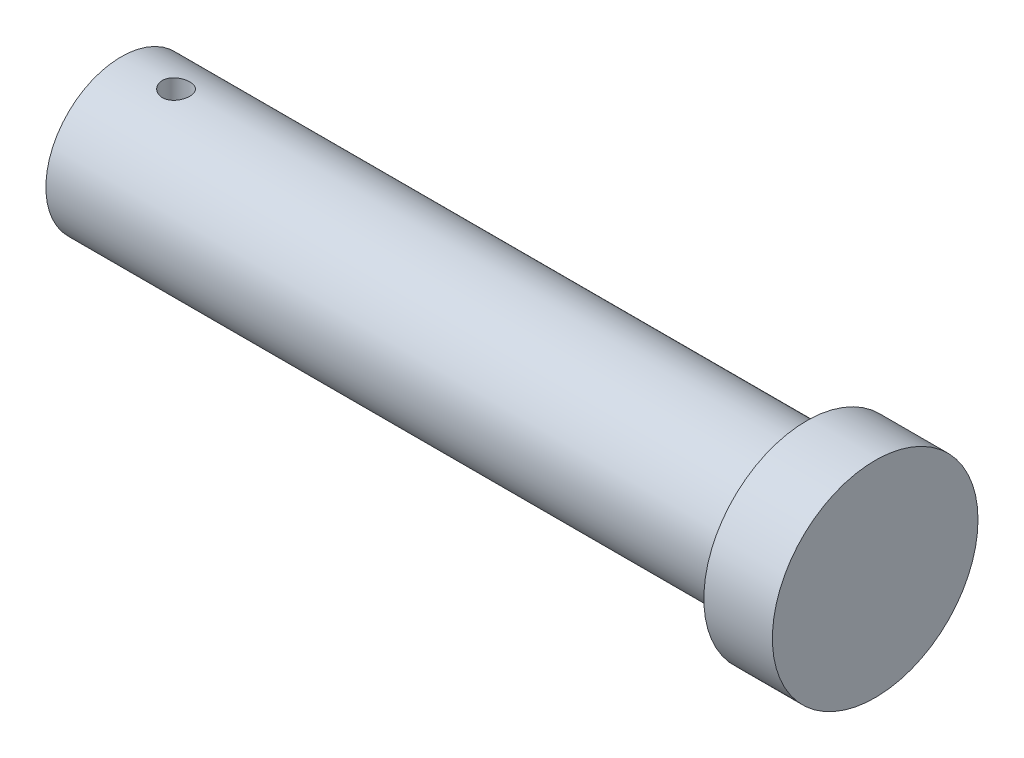
ISO-10303-21;
HEADER;
FILE_DESCRIPTION(('STEP AP214'),'2;1');
FILE_NAME('part.step','',(''),(''),'','','');
FILE_SCHEMA(('AUTOMOTIVE_DESIGN { 1 0 10303 214 1 1 1 1 }'));
ENDSEC;
DATA;
#1=APPLICATION_CONTEXT('core data for automotive mechanical design processes');
#2=APPLICATION_PROTOCOL_DEFINITION('international standard','automotive_design',2000,#1);
#3=PRODUCT_CONTEXT('',#1,'mechanical');
#4=PRODUCT('Part','Part','',(#3));
#5=PRODUCT_RELATED_PRODUCT_CATEGORY('part','',(#4));
#6=PRODUCT_DEFINITION_FORMATION('','',#4);
#7=PRODUCT_DEFINITION_CONTEXT('part definition',#1,'design');
#8=PRODUCT_DEFINITION('design','',#6,#7);
#9=PRODUCT_DEFINITION_SHAPE('','',#8);
#10=(LENGTH_UNIT() NAMED_UNIT(*) SI_UNIT(.MILLI.,.METRE.));
#11=(NAMED_UNIT(*) PLANE_ANGLE_UNIT() SI_UNIT($,.RADIAN.));
#12=(NAMED_UNIT(*) SI_UNIT($,.STERADIAN.) SOLID_ANGLE_UNIT());
#13=UNCERTAINTY_MEASURE_WITH_UNIT(LENGTH_MEASURE(1.E-05),#10,'distance_accuracy_value','');
#14=(GEOMETRIC_REPRESENTATION_CONTEXT(3) GLOBAL_UNCERTAINTY_ASSIGNED_CONTEXT((#13)) GLOBAL_UNIT_ASSIGNED_CONTEXT((#10,
#11,#12)) REPRESENTATION_CONTEXT('',''));
#15=CARTESIAN_POINT('',(0.,0.,0.));
#16=DIRECTION('',(0.,0.,1.));
#17=DIRECTION('',(1.,0.,0.));
#18=AXIS2_PLACEMENT_3D('',#15,#16,#17);
#19=CARTESIAN_POINT('',(50.,0.,0.));
#20=DIRECTION('',(-1.,0.,0.));
#21=DIRECTION('',(0.,0.,1.));
#22=AXIS2_PLACEMENT_3D('',#19,#20,#21);
#23=CYLINDRICAL_SURFACE('',#22,5.5);
#24=CARTESIAN_POINT('',(4.,-5.40832691319598,1.));
#25=CARTESIAN_POINT('',(4.05567006127892,-5.40832797364528,0.999997833744766));
#26=CARTESIAN_POINT('',(4.11136859562177,-5.40919579392021,0.995335502119674));
#27=CARTESIAN_POINT('',(4.22119730791599,-5.41256931618596,0.976820659835411));
#28=CARTESIAN_POINT('',(4.27532607983057,-5.41507644189578,0.962960160510875));
#29=CARTESIAN_POINT('',(4.38041015651648,-5.4214354513315,0.926486846446966));
#30=CARTESIAN_POINT('',(4.43136828265596,-5.42528611875607,0.903881945963433));
#31=CARTESIAN_POINT('',(4.52876494581254,-5.43389689920319,0.850582127042014));
#32=CARTESIAN_POINT('',(4.57520387900767,-5.438656932397,0.819887918635019));
#33=CARTESIAN_POINT('',(4.6627917237214,-5.4486123689521,0.750897624119711));
#34=CARTESIAN_POINT('',(4.70388003711712,-5.45381181531897,0.712525176739021));
#35=CARTESIAN_POINT('',(4.77907278141707,-5.46402446588599,0.62943269817084));
#36=CARTESIAN_POINT('',(4.81317676682265,-5.46903765818916,0.584712262381758));
#37=CARTESIAN_POINT('',(4.87366365922516,-5.47835611996116,0.489796709499925));
#38=CARTESIAN_POINT('',(4.89998963499791,-5.48265607320122,0.439564745239941));
#39=CARTESIAN_POINT('',(4.94380666651306,-5.49001838668285,0.335299887218807));
#40=CARTESIAN_POINT('',(4.96129840525468,-5.49308084259509,0.28126728766334));
#41=CARTESIAN_POINT('',(4.98676361662773,-5.49759455294158,0.171562418910428));
#42=CARTESIAN_POINT('',(4.99483915716036,-5.49906307272621,0.115914564259384));
#43=CARTESIAN_POINT('',(5.0015605837312,-5.50028290444734,0.00403573648296232));
#44=CARTESIAN_POINT('',(5.00020722678577,-5.50003435424197,-0.0521951894675192));
#45=CARTESIAN_POINT('',(4.98818792896104,-5.49786159276056,-0.16294459807037));
#46=CARTESIAN_POINT('',(4.97763187324278,-5.49595715438454,-0.217475450026675));
#47=CARTESIAN_POINT('',(4.94768040126925,-5.49070873453988,-0.323978745301683));
#48=CARTESIAN_POINT('',(4.92828467730688,-5.48736470295951,-0.375951099489802));
#49=CARTESIAN_POINT('',(4.88109847011042,-5.47957960186178,-0.476183112726924));
#50=CARTESIAN_POINT('',(4.85326367798308,-5.47513276511691,-0.524421446258733));
#51=CARTESIAN_POINT('',(4.79002205503766,-5.46563448410861,-0.615583816786463));
#52=CARTESIAN_POINT('',(4.75461449853225,-5.4605829819214,-0.65850734384911));
#53=CARTESIAN_POINT('',(4.67662577271036,-5.4503495404642,-0.738472225271972));
#54=CARTESIAN_POINT('',(4.63394849104051,-5.44516677076057,-0.775419797024746));
#55=CARTESIAN_POINT('',(4.54295296803954,-5.4353248103429,-0.84164635982083));
#56=CARTESIAN_POINT('',(4.49463465361737,-5.43066562641452,-0.870925251484836));
#57=CARTESIAN_POINT('',(4.39360874475659,-5.42239736704917,-0.921007691245463));
#58=CARTESIAN_POINT('',(4.34089458418011,-5.41878990006369,-0.941798276926112));
#59=CARTESIAN_POINT('',(4.23264127505582,-5.41305866738468,-0.97420188443499));
#60=CARTESIAN_POINT('',(4.17710242674443,-5.41093474435718,-0.985815879483377));
#61=CARTESIAN_POINT('',(4.0656200993973,-5.40844202046372,-0.999401089257729));
#62=CARTESIAN_POINT('',(4.00969353366518,-5.40804875191389,-1.00150674244582));
#63=CARTESIAN_POINT('',(3.89828772471946,-5.40899647576945,-0.996375273894247));
#64=CARTESIAN_POINT('',(3.84280846089302,-5.41033738779432,-0.989138585178942));
#65=CARTESIAN_POINT('',(3.73430982797386,-5.41457964689337,-0.965643048194485));
#66=CARTESIAN_POINT('',(3.68127480799599,-5.41746890003943,-0.94945409427688));
#67=CARTESIAN_POINT('',(3.57867014058578,-5.42447195400378,-0.908587487859388));
#68=CARTESIAN_POINT('',(3.52910073545716,-5.42858584033864,-0.88390924253054));
#69=CARTESIAN_POINT('',(3.43424040199238,-5.43763067076332,-0.826452930939968));
#70=CARTESIAN_POINT('',(3.38900194095781,-5.44257002421489,-0.793589589707832));
#71=CARTESIAN_POINT('',(3.30463315420112,-5.45268533146011,-0.720811524753681));
#72=CARTESIAN_POINT('',(3.26550334400017,-5.45786130517501,-0.680896206506622));
#73=CARTESIAN_POINT('',(3.19396357692511,-5.46794493022657,-0.594548150036306));
#74=CARTESIAN_POINT('',(3.1616438223191,-5.47284841413378,-0.548040116261882));
#75=CARTESIAN_POINT('',(3.1052768469585,-5.48176540688883,-0.450176309896763));
#76=CARTESIAN_POINT('',(3.08122932136141,-5.48577894853028,-0.398820716033923));
#77=CARTESIAN_POINT('',(3.04222598068178,-5.49244586315787,-0.292974109172671));
#78=CARTESIAN_POINT('',(3.02722504756174,-5.49510597552399,-0.238500164676974));
#79=CARTESIAN_POINT('',(3.00659632835142,-5.49879498739045,-0.12775332448174));
#80=CARTESIAN_POINT('',(3.00096761743164,-5.49982404783879,-0.0714806068396169));
#81=CARTESIAN_POINT('',(2.99927373944725,-5.50013207106945,0.0403998095144108));
#82=CARTESIAN_POINT('',(3.00307205575767,-5.49943601615581,0.0960054189627312));
#83=CARTESIAN_POINT('',(3.01982647321196,-5.49642366951049,0.205772269495427));
#84=CARTESIAN_POINT('',(3.03278249759946,-5.4941073913589,0.259933522681888));
#85=CARTESIAN_POINT('',(3.06742845174468,-5.48811453453941,0.365207716720242));
#86=CARTESIAN_POINT('',(3.08910467268796,-5.48444009174284,0.416325298323197));
#87=CARTESIAN_POINT('',(3.1405597014042,-5.47612961195727,0.514218505970988));
#88=CARTESIAN_POINT('',(3.17033900813803,-5.47149351575705,0.560993864398312));
#89=CARTESIAN_POINT('',(3.23762881928164,-5.46169295104726,0.64955729876811));
#90=CARTESIAN_POINT('',(3.27523834769477,-5.45652218977741,0.69126944929362));
#91=CARTESIAN_POINT('',(3.35691475834417,-5.44627585142043,0.767838111774054));
#92=CARTESIAN_POINT('',(3.40098315427109,-5.44120029696122,0.802693012176555));
#93=CARTESIAN_POINT('',(3.49477983780895,-5.43167141434991,0.864838359022299));
#94=CARTESIAN_POINT('',(3.54455361968942,-5.42722382409738,0.892061042527094));
#95=CARTESIAN_POINT('',(3.64803163839711,-5.41952308783751,0.937715294552637));
#96=CARTESIAN_POINT('',(3.70173204581306,-5.41626879622786,0.956155299818061));
#97=CARTESIAN_POINT('',(3.79633834221095,-5.41201405367096,0.979899481024946));
#98=CARTESIAN_POINT('',(3.83668463130228,-5.4106394360599,0.987424495948277));
#99=CARTESIAN_POINT('',(3.91801547601812,-5.40879548637076,0.997475492125671));
#100=CARTESIAN_POINT('',(3.95900001603777,-5.40832613219443,1.00000159540744));
#101=CARTESIAN_POINT('',(4.,-5.40832691319598,1.));
#102=B_SPLINE_CURVE_WITH_KNOTS('',3,(#24,#25,#26,#27,#28,#29,#30,#31,#32,#33,#34,#35,#36,#37,
#38,#39,#40,#41,#42,#43,#44,#45,#46,#47,#48,#49,#50,#51,#52,#53,#54,#55,#56,#57,#58,#59,#60,#61,
#62,#63,#64,#65,#66,#67,#68,#69,#70,#71,#72,#73,#74,#75,#76,#77,#78,#79,#80,#81,#82,#83,#84,#85,
#86,#87,#88,#89,#90,#91,#92,#93,#94,#95,#96,#97,#98,#99,#100,#101),.UNSPECIFIED.,.T.,.F.,(4,2,2,
2,2,2,2,2,2,2,2,2,2,2,2,2,2,2,2,2,2,2,2,2,2,2,2,2,2,2,2,2,2,2,2,2,2,2,4),(0.,0.166860176303694,
0.333865461691934,0.500719948670007,0.667559795037679,0.836149675555551,1.00475030631164,
1.17455606253914,1.34434868860495,1.51228319705907,1.6802042227379,1.84614722644409,
2.01209600703444,2.17893164241915,2.34578327259646,2.51504175421998,2.68430242917503,
2.85382062241291,3.02332083504319,3.19041682321415,3.35750506664222,3.52330682829013,
3.68912017065095,3.85673910114988,4.02437216970491,4.19410261282722,4.36382680048964,
4.53269736835609,4.70155127147238,4.86797423941391,5.03439581247914,5.20055677418129,
5.36672796983505,5.53514439851506,5.70360036032117,5.87350774145283,6.04325157670206,
6.16614405072609,6.28903352480283),.UNSPECIFIED.);
#103=CARTESIAN_POINT('',(4.,-5.40832691319598,1.));
#104=VERTEX_POINT('',#103);
#105=EDGE_CURVE('E35',#104,#104,#102,.T.);
#106=ORIENTED_EDGE('',*,*,#105,.T.);
#107=EDGE_LOOP('',(#106));
#108=FACE_BOUND('',#107,.T.);
#109=CARTESIAN_POINT('',(4.,5.40832691319598,1.));
#110=CARTESIAN_POINT('',(3.94432993872108,5.40832797364528,0.999997833744766));
#111=CARTESIAN_POINT('',(3.88863140437823,5.40919579392021,0.995335502119674));
#112=CARTESIAN_POINT('',(3.77880269208401,5.41256931618596,0.976820659835411));
#113=CARTESIAN_POINT('',(3.72467392016943,5.41507644189578,0.962960160510875));
#114=CARTESIAN_POINT('',(3.61958984348352,5.4214354513315,0.926486846446966));
#115=CARTESIAN_POINT('',(3.56863171734404,5.42528611875607,0.903881945963433));
#116=CARTESIAN_POINT('',(3.47123505418746,5.43389689920319,0.850582127042014));
#117=CARTESIAN_POINT('',(3.42479612099233,5.438656932397,0.819887918635019));
#118=CARTESIAN_POINT('',(3.3372082762786,5.4486123689521,0.750897624119711));
#119=CARTESIAN_POINT('',(3.29611996288288,5.45381181531897,0.71252517673902));
#120=CARTESIAN_POINT('',(3.22092721858293,5.46402446588599,0.629432698170839));
#121=CARTESIAN_POINT('',(3.18682323317735,5.46903765818916,0.584712262381757));
#122=CARTESIAN_POINT('',(3.12633634077484,5.47835611996116,0.489796709499924));
#123=CARTESIAN_POINT('',(3.10001036500209,5.48265607320122,0.439564745239941));
#124=CARTESIAN_POINT('',(3.05619333348694,5.49001838668285,0.335299887218807));
#125=CARTESIAN_POINT('',(3.03870159474532,5.49308084259509,0.28126728766334));
#126=CARTESIAN_POINT('',(3.01323638337227,5.49759455294158,0.171562418910429));
#127=CARTESIAN_POINT('',(3.00516084283964,5.49906307272621,0.115914564259384));
#128=CARTESIAN_POINT('',(2.9984394162688,5.50028290444734,0.00403573648296255));
#129=CARTESIAN_POINT('',(2.99979277321423,5.50003435424197,-0.052195189467519));
#130=CARTESIAN_POINT('',(3.01181207103896,5.49786159276056,-0.16294459807037));
#131=CARTESIAN_POINT('',(3.02236812675722,5.49595715438454,-0.217475450026675));
#132=CARTESIAN_POINT('',(3.05231959873075,5.49070873453988,-0.323978745301683));
#133=CARTESIAN_POINT('',(3.07171532269312,5.48736470295951,-0.375951099489801));
#134=CARTESIAN_POINT('',(3.11890152988958,5.47957960186178,-0.476183112726923));
#135=CARTESIAN_POINT('',(3.14673632201692,5.47513276511691,-0.524421446258733));
#136=CARTESIAN_POINT('',(3.20997794496234,5.46563448410861,-0.615583816786463));
#137=CARTESIAN_POINT('',(3.24538550146775,5.4605829819214,-0.65850734384911));
#138=CARTESIAN_POINT('',(3.32337422728964,5.4503495404642,-0.738472225271972));
#139=CARTESIAN_POINT('',(3.36605150895949,5.44516677076057,-0.775419797024746));
#140=CARTESIAN_POINT('',(3.45704703196046,5.4353248103429,-0.841646359820829));
#141=CARTESIAN_POINT('',(3.50536534638263,5.43066562641452,-0.870925251484836));
#142=CARTESIAN_POINT('',(3.60639125524341,5.42239736704917,-0.921007691245462));
#143=CARTESIAN_POINT('',(3.65910541581989,5.41878990006368,-0.941798276926111));
#144=CARTESIAN_POINT('',(3.76735872494418,5.41305866738468,-0.974201884434989));
#145=CARTESIAN_POINT('',(3.82289757325557,5.41093474435718,-0.985815879483377));
#146=CARTESIAN_POINT('',(3.93437990060271,5.40844202046372,-0.999401089257729));
#147=CARTESIAN_POINT('',(3.99030646633482,5.40804875191389,-1.00150674244582));
#148=CARTESIAN_POINT('',(4.10171227528054,5.40899647576945,-0.996375273894247));
#149=CARTESIAN_POINT('',(4.15719153910698,5.41033738779432,-0.989138585178942));
#150=CARTESIAN_POINT('',(4.26569017202614,5.41457964689337,-0.965643048194485));
#151=CARTESIAN_POINT('',(4.31872519200401,5.41746890003943,-0.949454094276879));
#152=CARTESIAN_POINT('',(4.42132985941422,5.42447195400378,-0.908587487859388));
#153=CARTESIAN_POINT('',(4.47089926454284,5.42858584033864,-0.88390924253054));
#154=CARTESIAN_POINT('',(4.56575959800762,5.43763067076332,-0.826452930939968));
#155=CARTESIAN_POINT('',(4.61099805904219,5.44257002421489,-0.793589589707833));
#156=CARTESIAN_POINT('',(4.69536684579888,5.45268533146011,-0.720811524753681));
#157=CARTESIAN_POINT('',(4.73449665599983,5.45786130517501,-0.680896206506622));
#158=CARTESIAN_POINT('',(4.80603642307489,5.46794493022657,-0.594548150036305));
#159=CARTESIAN_POINT('',(4.8383561776809,5.47284841413378,-0.548040116261882));
#160=CARTESIAN_POINT('',(4.8947231530415,5.48176540688883,-0.450176309896763));
#161=CARTESIAN_POINT('',(4.91877067863859,5.48577894853028,-0.398820716033923));
#162=CARTESIAN_POINT('',(4.95777401931822,5.49244586315787,-0.292974109172671));
#163=CARTESIAN_POINT('',(4.97277495243826,5.49510597552399,-0.238500164676974));
#164=CARTESIAN_POINT('',(4.99340367164858,5.49879498739045,-0.12775332448174));
#165=CARTESIAN_POINT('',(4.99903238256836,5.49982404783879,-0.0714806068396171));
#166=CARTESIAN_POINT('',(5.00072626055275,5.50013207106945,0.0403998095144106));
#167=CARTESIAN_POINT('',(4.99692794424233,5.49943601615581,0.0960054189627311));
#168=CARTESIAN_POINT('',(4.98017352678804,5.49642366951049,0.205772269495427));
#169=CARTESIAN_POINT('',(4.96721750240054,5.4941073913589,0.259933522681888));
#170=CARTESIAN_POINT('',(4.93257154825532,5.48811453453941,0.365207716720242));
#171=CARTESIAN_POINT('',(4.91089532731204,5.48444009174284,0.416325298323197));
#172=CARTESIAN_POINT('',(4.8594402985958,5.47612961195727,0.514218505970988));
#173=CARTESIAN_POINT('',(4.82966099186197,5.47149351575705,0.560993864398311));
#174=CARTESIAN_POINT('',(4.76237118071836,5.46169295104726,0.64955729876811));
#175=CARTESIAN_POINT('',(4.72476165230523,5.45652218977741,0.69126944929362));
#176=CARTESIAN_POINT('',(4.64308524165583,5.44627585142043,0.767838111774055));
#177=CARTESIAN_POINT('',(4.59901684572891,5.44120029696122,0.802693012176555));
#178=CARTESIAN_POINT('',(4.50522016219105,5.43167141434991,0.864838359022299));
#179=CARTESIAN_POINT('',(4.45544638031058,5.42722382409738,0.892061042527094));
#180=CARTESIAN_POINT('',(4.35196836160289,5.41952308783751,0.937715294552637));
#181=CARTESIAN_POINT('',(4.29826795418694,5.41626879622786,0.956155299818061));
#182=CARTESIAN_POINT('',(4.20366165778905,5.41201405367096,0.979899481024945));
#183=CARTESIAN_POINT('',(4.16331536869772,5.4106394360599,0.987424495948277));
#184=CARTESIAN_POINT('',(4.08198452398188,5.40879548637076,0.997475492125671));
#185=CARTESIAN_POINT('',(4.04099998396223,5.40832613219443,1.00000159540744));
#186=CARTESIAN_POINT('',(4.,5.40832691319598,1.));
#187=B_SPLINE_CURVE_WITH_KNOTS('',3,(#109,#110,#111,#112,#113,#114,#115,#116,#117,#118,#119,
#120,#121,#122,#123,#124,#125,#126,#127,#128,#129,#130,#131,#132,#133,#134,#135,#136,#137,#138,
#139,#140,#141,#142,#143,#144,#145,#146,#147,#148,#149,#150,#151,#152,#153,#154,#155,#156,#157,
#158,#159,#160,#161,#162,#163,#164,#165,#166,#167,#168,#169,#170,#171,#172,#173,#174,#175,#176,
#177,#178,#179,#180,#181,#182,#183,#184,#185,#186),.UNSPECIFIED.,.T.,.F.,(4,2,2,2,2,2,2,2,2,2,2,
2,2,2,2,2,2,2,2,2,2,2,2,2,2,2,2,2,2,2,2,2,2,2,2,2,2,2,4),(0.,0.166860176303694,
0.333865461691933,0.500719948670007,0.66755979503768,0.836149675555552,1.00475030631164,
1.17455606253914,1.34434868860495,1.51228319705907,1.6802042227379,1.84614722644409,
2.01209600703444,2.17893164241915,2.34578327259646,2.51504175421998,2.68430242917503,
2.85382062241291,3.02332083504319,3.19041682321415,3.35750506664222,3.52330682829013,
3.68912017065095,3.85673910114988,4.02437216970491,4.19410261282722,4.36382680048964,
4.53269736835609,4.70155127147238,4.86797423941391,5.03439581247915,5.20055677418129,
5.36672796983505,5.53514439851506,5.70360036032117,5.87350774145283,6.04325157670206,
6.16614405072609,6.28903352480283),.UNSPECIFIED.);
#188=CARTESIAN_POINT('',(4.,5.40832691319598,1.));
#189=VERTEX_POINT('',#188);
#190=EDGE_CURVE('E53',#189,#189,#187,.T.);
#191=ORIENTED_EDGE('',*,*,#190,.T.);
#192=EDGE_LOOP('',(#191));
#193=FACE_BOUND('',#192,.T.);
#194=CARTESIAN_POINT('',(50.,0.,0.));
#195=DIRECTION('',(1.,0.,0.));
#196=DIRECTION('',(0.,0.,-1.));
#197=AXIS2_PLACEMENT_3D('',#194,#195,#196);
#198=CIRCLE('',#197,5.5);
#199=CARTESIAN_POINT('',(50.,0.,-5.5));
#200=VERTEX_POINT('',#199);
#201=EDGE_CURVE('E10',#200,#200,#198,.T.);
#202=ORIENTED_EDGE('',*,*,#201,.F.);
#203=EDGE_LOOP('',(#202));
#204=FACE_BOUND('',#203,.T.);
#205=CARTESIAN_POINT('',(0.,0.,0.));
#206=DIRECTION('',(1.,0.,0.));
#207=DIRECTION('',(0.,0.,-1.));
#208=AXIS2_PLACEMENT_3D('',#205,#206,#207);
#209=CIRCLE('',#208,5.5);
#210=CARTESIAN_POINT('',(0.,0.,-5.5));
#211=VERTEX_POINT('',#210);
#212=EDGE_CURVE('E43',#211,#211,#209,.T.);
#213=ORIENTED_EDGE('',*,*,#212,.T.);
#214=EDGE_LOOP('',(#213));
#215=FACE_BOUND('',#214,.T.);
#216=ADVANCED_FACE('F31',(#108,#193,#204,#215),#23,.T.);
#217=CARTESIAN_POINT('',(0.,0.,0.));
#218=DIRECTION('',(1.,0.,0.));
#219=DIRECTION('',(0.,0.,-1.));
#220=AXIS2_PLACEMENT_3D('',#217,#218,#219);
#221=PLANE('',#220);
#222=ORIENTED_EDGE('',*,*,#212,.F.);
#223=EDGE_LOOP('',(#222));
#224=FACE_BOUND('',#223,.T.);
#225=ADVANCED_FACE('F73',(#224),#221,.F.);
#226=CARTESIAN_POINT('',(55.,0.,0.));
#227=DIRECTION('',(-1.,0.,0.));
#228=DIRECTION('',(0.,0.,1.));
#229=AXIS2_PLACEMENT_3D('',#226,#227,#228);
#230=CYLINDRICAL_SURFACE('',#229,7.5);
#231=CARTESIAN_POINT('',(55.,0.,0.));
#232=DIRECTION('',(1.,0.,0.));
#233=DIRECTION('',(0.,0.,-1.));
#234=AXIS2_PLACEMENT_3D('',#231,#232,#233);
#235=CIRCLE('',#234,7.5);
#236=CARTESIAN_POINT('',(55.,0.,-7.5));
#237=VERTEX_POINT('',#236);
#238=EDGE_CURVE('E48',#237,#237,#235,.T.);
#239=ORIENTED_EDGE('',*,*,#238,.F.);
#240=EDGE_LOOP('',(#239));
#241=FACE_BOUND('',#240,.T.);
#242=CARTESIAN_POINT('',(50.,0.,0.));
#243=DIRECTION('',(1.,0.,0.));
#244=DIRECTION('',(0.,0.,-1.));
#245=AXIS2_PLACEMENT_3D('',#242,#243,#244);
#246=CIRCLE('',#245,7.5);
#247=CARTESIAN_POINT('',(50.,0.,-7.5));
#248=VERTEX_POINT('',#247);
#249=EDGE_CURVE('E51',#248,#248,#246,.T.);
#250=ORIENTED_EDGE('',*,*,#249,.T.);
#251=EDGE_LOOP('',(#250));
#252=FACE_BOUND('',#251,.T.);
#253=ADVANCED_FACE('F68',(#241,#252),#230,.T.);
#254=CARTESIAN_POINT('',(55.,0.,0.));
#255=DIRECTION('',(1.,0.,0.));
#256=DIRECTION('',(0.,0.,-1.));
#257=AXIS2_PLACEMENT_3D('',#254,#255,#256);
#258=PLANE('',#257);
#259=ORIENTED_EDGE('',*,*,#238,.T.);
#260=EDGE_LOOP('',(#259));
#261=FACE_BOUND('',#260,.T.);
#262=ADVANCED_FACE('F64',(#261),#258,.T.);
#263=CARTESIAN_POINT('',(50.,0.,0.));
#264=DIRECTION('',(1.,0.,0.));
#265=DIRECTION('',(0.,0.,-1.));
#266=AXIS2_PLACEMENT_3D('',#263,#264,#265);
#267=PLANE('',#266);
#268=ORIENTED_EDGE('',*,*,#201,.T.);
#269=EDGE_LOOP('',(#268));
#270=FACE_BOUND('',#269,.T.);
#271=ORIENTED_EDGE('',*,*,#249,.F.);
#272=EDGE_LOOP('',(#271));
#273=FACE_BOUND('',#272,.T.);
#274=ADVANCED_FACE('F62',(#270,#273),#267,.F.);
#275=CARTESIAN_POINT('',(4.,-7.5,0.));
#276=DIRECTION('',(0.,1.,0.));
#277=DIRECTION('',(0.,0.,1.));
#278=AXIS2_PLACEMENT_3D('',#275,#276,#277);
#279=CYLINDRICAL_SURFACE('',#278,1.);
#280=ORIENTED_EDGE('',*,*,#190,.F.);
#281=EDGE_LOOP('',(#280));
#282=FACE_BOUND('',#281,.T.);
#283=ORIENTED_EDGE('',*,*,#105,.F.);
#284=EDGE_LOOP('',(#283));
#285=FACE_BOUND('',#284,.T.);
#286=ADVANCED_FACE('F58',(#282,#285),#279,.F.);
#287=CLOSED_SHELL('',(#216,#225,#253,#262,#274,#286));
#288=MANIFOLD_SOLID_BREP('B2',#287);
#289=ADVANCED_BREP_SHAPE_REPRESENTATION('',(#18,#288),#14);
#290=SHAPE_DEFINITION_REPRESENTATION(#9,#289);
ENDSEC;
END-ISO-10303-21;
